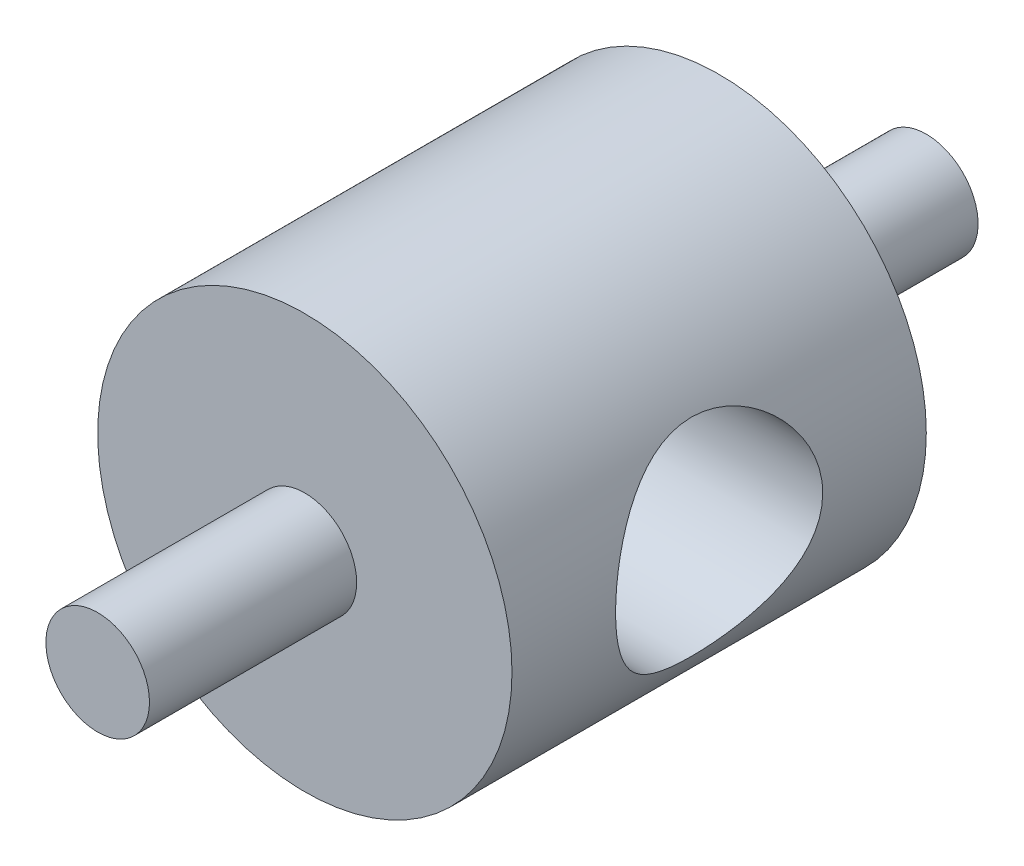
ISO-10303-21;
HEADER;
FILE_DESCRIPTION(('STEP AP214'),'2;1');
FILE_NAME('part.step','',(''),(''),'','','');
FILE_SCHEMA(('AUTOMOTIVE_DESIGN { 1 0 10303 214 1 1 1 1 }'));
ENDSEC;
DATA;
#1=APPLICATION_CONTEXT('core data for automotive mechanical design processes');
#2=APPLICATION_PROTOCOL_DEFINITION('international standard','automotive_design',2000,#1);
#3=PRODUCT_CONTEXT('',#1,'mechanical');
#4=PRODUCT('Part','Part','',(#3));
#5=PRODUCT_RELATED_PRODUCT_CATEGORY('part','',(#4));
#6=PRODUCT_DEFINITION_FORMATION('','',#4);
#7=PRODUCT_DEFINITION_CONTEXT('part definition',#1,'design');
#8=PRODUCT_DEFINITION('design','',#6,#7);
#9=PRODUCT_DEFINITION_SHAPE('','',#8);
#10=(LENGTH_UNIT() NAMED_UNIT(*) SI_UNIT(.MILLI.,.METRE.));
#11=(NAMED_UNIT(*) PLANE_ANGLE_UNIT() SI_UNIT($,.RADIAN.));
#12=(NAMED_UNIT(*) SI_UNIT($,.STERADIAN.) SOLID_ANGLE_UNIT());
#13=UNCERTAINTY_MEASURE_WITH_UNIT(LENGTH_MEASURE(1.E-05),#10,'distance_accuracy_value','');
#14=(GEOMETRIC_REPRESENTATION_CONTEXT(3) GLOBAL_UNCERTAINTY_ASSIGNED_CONTEXT((#13)) GLOBAL_UNIT_ASSIGNED_CONTEXT((#10,
#11,#12)) REPRESENTATION_CONTEXT('',''));
#15=CARTESIAN_POINT('',(0.,0.,0.));
#16=DIRECTION('',(0.,0.,1.));
#17=DIRECTION('',(1.,0.,0.));
#18=AXIS2_PLACEMENT_3D('',#15,#16,#17);
#19=CARTESIAN_POINT('',(0.,0.,-12.7));
#20=DIRECTION('',(0.,0.,1.));
#21=DIRECTION('',(1.,0.,0.));
#22=AXIS2_PLACEMENT_3D('',#19,#20,#21);
#23=CYLINDRICAL_SURFACE('',#22,1.5875);
#24=CARTESIAN_POINT('',(0.,0.,-12.7));
#25=DIRECTION('',(0.,0.,-1.));
#26=DIRECTION('',(-1.,0.,0.));
#27=AXIS2_PLACEMENT_3D('',#24,#25,#26);
#28=CIRCLE('',#27,1.5875);
#29=CARTESIAN_POINT('',(-1.5875,0.,-12.7));
#30=VERTEX_POINT('',#29);
#31=EDGE_CURVE('E11',#30,#30,#28,.T.);
#32=ORIENTED_EDGE('',*,*,#31,.F.);
#33=EDGE_LOOP('',(#32));
#34=FACE_BOUND('',#33,.T.);
#35=CARTESIAN_POINT('',(0.,0.,-3.175));
#36=DIRECTION('',(0.,0.,-1.));
#37=DIRECTION('',(-1.,0.,0.));
#38=AXIS2_PLACEMENT_3D('',#35,#36,#37);
#39=CIRCLE('',#38,1.5875);
#40=CARTESIAN_POINT('',(-1.5875,0.,-3.175));
#41=VERTEX_POINT('',#40);
#42=EDGE_CURVE('E373',#41,#41,#39,.T.);
#43=ORIENTED_EDGE('',*,*,#42,.T.);
#44=EDGE_LOOP('',(#43));
#45=FACE_BOUND('',#44,.T.);
#46=ADVANCED_FACE('F367',(#34,#45),#23,.T.);
#47=CARTESIAN_POINT('',(0.,0.,-12.7));
#48=DIRECTION('',(0.,0.,-1.));
#49=DIRECTION('',(-1.,0.,0.));
#50=AXIS2_PLACEMENT_3D('',#47,#48,#49);
#51=PLANE('',#50);
#52=ORIENTED_EDGE('',*,*,#31,.T.);
#53=EDGE_LOOP('',(#52));
#54=FACE_BOUND('',#53,.T.);
#55=ADVANCED_FACE('F382',(#54),#51,.T.);
#56=CARTESIAN_POINT('',(0.,0.,-3.175));
#57=DIRECTION('',(0.,0.,-1.));
#58=DIRECTION('',(-1.,0.,0.));
#59=AXIS2_PLACEMENT_3D('',#56,#57,#58);
#60=PLANE('',#59);
#61=ORIENTED_EDGE('',*,*,#42,.F.);
#62=EDGE_LOOP('',(#61));
#63=FACE_BOUND('',#62,.T.);
#64=ADVANCED_FACE('F380',(#63),#60,.F.);
#65=CLOSED_SHELL('',(#46,#55,#64));
#66=MANIFOLD_SOLID_BREP('B2',#65);
#67=CARTESIAN_POINT('',(0.,0.,12.7));
#68=DIRECTION('',(0.,0.,-1.));
#69=DIRECTION('',(-1.,0.,0.));
#70=AXIS2_PLACEMENT_3D('',#67,#68,#69);
#71=CYLINDRICAL_SURFACE('',#70,1.5875);
#72=CARTESIAN_POINT('',(0.,0.,12.7));
#73=DIRECTION('',(0.,0.,1.));
#74=DIRECTION('',(1.,0.,0.));
#75=AXIS2_PLACEMENT_3D('',#72,#73,#74);
#76=CIRCLE('',#75,1.5875);
#77=CARTESIAN_POINT('',(1.5875,0.,12.7));
#78=VERTEX_POINT('',#77);
#79=EDGE_CURVE('E366',#78,#78,#76,.T.);
#80=ORIENTED_EDGE('',*,*,#79,.F.);
#81=EDGE_LOOP('',(#80));
#82=FACE_BOUND('',#81,.T.);
#83=CARTESIAN_POINT('',(0.,0.,3.175));
#84=DIRECTION('',(0.,0.,1.));
#85=DIRECTION('',(1.,0.,0.));
#86=AXIS2_PLACEMENT_3D('',#83,#84,#85);
#87=CIRCLE('',#86,1.5875);
#88=CARTESIAN_POINT('',(1.5875,0.,3.175));
#89=VERTEX_POINT('',#88);
#90=EDGE_CURVE('E414',#89,#89,#87,.T.);
#91=ORIENTED_EDGE('',*,*,#90,.T.);
#92=EDGE_LOOP('',(#91));
#93=FACE_BOUND('',#92,.T.);
#94=ADVANCED_FACE('F408',(#82,#93),#71,.T.);
#95=CARTESIAN_POINT('',(0.,0.,12.7));
#96=DIRECTION('',(0.,0.,1.));
#97=DIRECTION('',(1.,0.,0.));
#98=AXIS2_PLACEMENT_3D('',#95,#96,#97);
#99=PLANE('',#98);
#100=ORIENTED_EDGE('',*,*,#79,.T.);
#101=EDGE_LOOP('',(#100));
#102=FACE_BOUND('',#101,.T.);
#103=ADVANCED_FACE('F423',(#102),#99,.T.);
#104=CARTESIAN_POINT('',(0.,0.,3.175));
#105=DIRECTION('',(0.,0.,1.));
#106=DIRECTION('',(1.,0.,0.));
#107=AXIS2_PLACEMENT_3D('',#104,#105,#106);
#108=PLANE('',#107);
#109=ORIENTED_EDGE('',*,*,#90,.F.);
#110=EDGE_LOOP('',(#109));
#111=FACE_BOUND('',#110,.T.);
#112=ADVANCED_FACE('F421',(#111),#108,.F.);
#113=CLOSED_SHELL('',(#94,#103,#112));
#114=MANIFOLD_SOLID_BREP('B6',#113);
#115=CARTESIAN_POINT('',(0.,0.,6.35));
#116=DIRECTION('',(0.,0.,-1.));
#117=DIRECTION('',(-1.,0.,0.));
#118=AXIS2_PLACEMENT_3D('',#115,#116,#117);
#119=CYLINDRICAL_SURFACE('',#118,6.35);
#120=CARTESIAN_POINT('',(6.35,0.,3.175));
#121=CARTESIAN_POINT('',(6.34999931166444,0.0834969220594998,3.17499911228237));
#122=CARTESIAN_POINT('',(6.34834758911701,0.167002655580042,3.17170012555405));
#123=CARTESIAN_POINT('',(6.34179105821714,0.333378330258781,3.15855412545011));
#124=CARTESIAN_POINT('',(6.33688483467113,0.416247978955771,3.14870426347423));
#125=CARTESIAN_POINT('',(6.31742426748325,0.66318203064701,3.10942793495399));
#126=CARTESIAN_POINT('',(6.29812827299425,0.825450146761554,3.0702749225986));
#127=CARTESIAN_POINT('',(6.2489182313574,1.13965128900426,2.96800928870585));
#128=CARTESIAN_POINT('',(6.21904547786825,1.29162180811868,2.90498978075659));
#129=CARTESIAN_POINT('',(6.15142812041637,1.58264035037879,2.7572639263711));
#130=CARTESIAN_POINT('',(6.11368413715877,1.72168939123018,2.67255928984904));
#131=CARTESIAN_POINT('',(6.03111096182982,1.99234108848171,2.47803037026578));
#132=CARTESIAN_POINT('',(5.98599127270818,2.12298433900091,2.36699642220607));
#133=CARTESIAN_POINT('',(5.89470535591056,2.36467069069853,2.12560331642721));
#134=CARTESIAN_POINT('',(5.84853836069043,2.47569885601321,1.99522957023356));
#135=CARTESIAN_POINT('',(5.75623634934464,2.68368848497886,1.70657905224669));
#136=CARTESIAN_POINT('',(5.71038146176788,2.77889135161934,1.54692246869841));
#137=CARTESIAN_POINT('',(5.64919759286363,2.90019349951534,1.29545201282557));
#138=CARTESIAN_POINT('',(5.63006420805933,2.93705266116892,1.20959993817132));
#139=CARTESIAN_POINT('',(5.59504604853267,3.00322508739606,1.03441438629358));
#140=CARTESIAN_POINT('',(5.57915935583429,3.03254280972159,0.945083001819447));
#141=CARTESIAN_POINT('',(5.55212611635049,3.08174263292982,0.768989448035257));
#142=CARTESIAN_POINT('',(5.54075429137746,3.10208128111978,0.682389205971436));
#143=CARTESIAN_POINT('',(5.52193654886444,3.13545600360765,0.507412721005601));
#144=CARTESIAN_POINT('',(5.51448854851135,3.14849595237257,0.419037446228298));
#145=CARTESIAN_POINT('',(5.50383875782918,3.1670771305344,0.241293261151383));
#146=CARTESIAN_POINT('',(5.50063441026522,3.1726228759965,0.151924982012601));
#147=CARTESIAN_POINT('',(5.49859788398609,3.17614778806993,-0.0269807841780854));
#148=CARTESIAN_POINT('',(5.49976528812799,3.17412767659872,-0.116518254271338));
#149=CARTESIAN_POINT('',(5.50899190362733,3.1581193033026,-0.362747875724405));
#150=CARTESIAN_POINT('',(5.52160857357707,3.13621253452965,-0.518841729813365));
#151=CARTESIAN_POINT('',(5.55866493052824,3.07003746372168,-0.82464664130653));
#152=CARTESIAN_POINT('',(5.58310838358077,3.02576203854504,-0.974355649022765));
#153=CARTESIAN_POINT('',(5.64157885407237,2.91531509833647,-1.26754429656414));
#154=CARTESIAN_POINT('',(5.67581583876129,2.84865758129418,-1.41079760993662));
#155=CARTESIAN_POINT('',(5.75003268807633,2.69570761526054,-1.68476608617402));
#156=CARTESIAN_POINT('',(5.79001512927804,2.60940634674629,-1.81547557960851));
#157=CARTESIAN_POINT('',(5.87734289018611,2.40685964249565,-2.07810427425029));
#158=CARTESIAN_POINT('',(5.92497898403936,2.28820488335253,-2.20807538485651));
#159=CARTESIAN_POINT('',(6.01813700574905,2.03058898448427,-2.44708514286384));
#160=CARTESIAN_POINT('',(6.06365791538158,1.89161819563546,-2.5561137863587));
#161=CARTESIAN_POINT('',(6.1500381059768,1.58913989972483,-2.75490191971972));
#162=CARTESIAN_POINT('',(6.19058274974572,1.42479265164789,-2.84353148557994));
#163=CARTESIAN_POINT('',(6.25976272299952,1.08098023585583,-2.99115808163535));
#164=CARTESIAN_POINT('',(6.28840750578946,0.901527205073897,-3.05017864113171));
#165=CARTESIAN_POINT('',(6.32854759690358,0.548533610626835,-3.13205940339905));
#166=CARTESIAN_POINT('',(6.34126679122995,0.375734359385247,-3.15750967258734));
#167=CARTESIAN_POINT('',(6.35231817716325,0.0278752299448336,-3.17965052226026));
#168=CARTESIAN_POINT('',(6.35065718436129,-0.147183538060017,-3.17635472713932));
#169=CARTESIAN_POINT('',(6.33384535408399,-0.480164686080361,-3.14259376405461));
#170=CARTESIAN_POINT('',(6.31975005060431,-0.638363620564188,-3.11425420852516));
#171=CARTESIAN_POINT('',(6.28085393924121,-0.947441883052999,-3.03454412179011));
#172=CARTESIAN_POINT('',(6.25605195113515,-1.09832040207141,-2.98317105152272));
#173=CARTESIAN_POINT('',(6.19709998236334,-1.39347133182512,-2.8575048690622));
#174=CARTESIAN_POINT('',(6.16270299610717,-1.53743151047822,-2.78259841588881));
#175=CARTESIAN_POINT('',(6.08787118465664,-1.8112148234104,-2.61268357431413));
#176=CARTESIAN_POINT('',(6.0474337895468,-1.94103189959927,-2.5176666226146));
#177=CARTESIAN_POINT('',(5.95973602709939,-2.19636241342679,-2.29946064962623));
#178=CARTESIAN_POINT('',(5.91219559251098,-2.3202013468198,-2.17442139288844));
#179=CARTESIAN_POINT('',(5.81858093231368,-2.54589381918874,-1.90523764485025));
#180=CARTESIAN_POINT('',(5.77250773963547,-2.6477321493525,-1.76108004761907));
#181=CARTESIAN_POINT('',(5.68487535288742,-2.83117262876716,-1.44893139804165));
#182=CARTESIAN_POINT('',(5.64364281441821,-2.91155594998014,-1.28012423048962));
#183=CARTESIAN_POINT('',(5.5744767953732,-3.04191297152938,-0.928655535110328));
#184=CARTESIAN_POINT('',(5.54652618900869,-3.0919258549222,-0.746012202152618));
#185=CARTESIAN_POINT('',(5.51057765714603,-3.15551086037918,-0.390810043529835));
#186=CARTESIAN_POINT('',(5.50092192343245,-3.17212027309711,-0.218966249592789));
#187=CARTESIAN_POINT('',(5.49800001145358,-3.17718805563876,0.125244442495203));
#188=CARTESIAN_POINT('',(5.5047267290444,-3.16565862768386,0.297611081542637));
#189=CARTESIAN_POINT('',(5.53205211477784,-3.11761548073658,0.620660103073908));
#190=CARTESIAN_POINT('',(5.55126823076269,-3.08358651207686,0.771843941731147));
#191=CARTESIAN_POINT('',(5.59977978302582,-2.99458164828807,1.06619083016717));
#192=CARTESIAN_POINT('',(5.62907846127335,-2.93959901505999,1.2093512828503));
#193=CARTESIAN_POINT('',(5.69685576337174,-2.8061154442137,1.49423369942854));
#194=CARTESIAN_POINT('',(5.73581889480533,-2.72628260503929,1.63521280936567));
#195=CARTESIAN_POINT('',(5.81772207082382,-2.54682759156583,1.9026974317231));
#196=CARTESIAN_POINT('',(5.8606641782013,-2.44719512169931,2.02919535994271));
#197=CARTESIAN_POINT('',(5.95192753761203,-2.21680287661219,2.28009752417706));
#198=CARTESIAN_POINT('',(6.00026839877346,-2.08373188558712,2.40237975641279));
#199=CARTESIAN_POINT('',(6.0921234557675,-1.79751265125244,2.62339787323312));
#200=CARTESIAN_POINT('',(6.13563504323042,-1.64435365457428,2.72212106598272));
#201=CARTESIAN_POINT('',(6.19391073190243,-1.40178715704487,2.85028026619707));
#202=CARTESIAN_POINT('',(6.21223173271383,-1.31842200030918,2.88980058368139));
#203=CARTESIAN_POINT('',(6.24595363475604,-1.1480770102167,2.9615994748237));
#204=CARTESIAN_POINT('',(6.26135597012704,-1.06109897786306,2.99388160653437));
#205=CARTESIAN_POINT('',(6.28875097111981,-0.884361322813109,3.050759345915));
#206=CARTESIAN_POINT('',(6.30075106809478,-0.794608244970573,3.07537171813811));
#207=CARTESIAN_POINT('',(6.32100983571903,-0.612925661591583,3.11666738952989));
#208=CARTESIAN_POINT('',(6.3292707916836,-0.520997521680291,3.13335553219354));
#209=CARTESIAN_POINT('',(6.34032503263334,-0.357531347524374,3.15561628486239));
#210=CARTESIAN_POINT('',(6.34394670812889,-0.286274046488595,3.16287882124963));
#211=CARTESIAN_POINT('',(6.34878452045567,-0.143346668941345,3.17257112653757));
#212=CARTESIAN_POINT('',(6.35000059089052,-0.0716765810914251,3.17500076204683));
#213=CARTESIAN_POINT('',(6.35,0.,3.175));
#214=B_SPLINE_CURVE_WITH_KNOTS('',3,(#120,#121,#122,#123,#124,#125,#126,#127,#128,#129,#130,
#131,#132,#133,#134,#135,#136,#137,#138,#139,#140,#141,#142,#143,#144,#145,#146,#147,#148,#149,
#150,#151,#152,#153,#154,#155,#156,#157,#158,#159,#160,#161,#162,#163,#164,#165,#166,#167,#168,
#169,#170,#171,#172,#173,#174,#175,#176,#177,#178,#179,#180,#181,#182,#183,#184,#185,#186,#187,
#188,#189,#190,#191,#192,#193,#194,#195,#196,#197,#198,#199,#200,#201,#202,#203,#204,#205,#206,
#207,#208,#209,#210,#211,#212,#213),.UNSPECIFIED.,.T.,.F.,(4,2,2,2,2,2,2,2,2,2,2,2,2,2,2,2,2,2,
2,2,2,2,2,2,2,2,2,2,2,2,2,2,2,2,2,2,2,2,2,2,2,2,2,2,2,2,4),(0.,0.25041561210268,
0.500940186864014,1.00234854488129,1.50182051324263,2.00125310940106,2.53090025348452,
3.06094897410615,3.63210298373098,3.91787290005988,4.20347350732849,4.47213270490102,
4.74064915090148,5.00900371453887,5.27733267302576,5.74927594687738,6.22136960256846,
6.70445970327764,7.18776712794021,7.73235646527881,8.27720530143646,8.84735553323666,
9.41705196489304,9.93956405039339,10.4618285011675,10.9436138594975,11.4254523397102,
11.9210677568139,12.4168946391879,12.9614122158798,13.5063050164601,14.0775857365549,
14.6481278321882,15.1639000911419,15.6794487286237,16.1458838633213,16.6124691169503,
17.1104020806943,17.6085946442304,18.1673210354482,18.7263477502426,19.0082017078365,
19.2899168101042,19.5710117490933,19.8519346536844,20.0668939492148,20.2818591776892),.UNSPECIFIED.);
#215=CARTESIAN_POINT('',(6.35,0.,3.175));
#216=VERTEX_POINT('',#215);
#217=EDGE_CURVE('E452',#216,#216,#214,.T.);
#218=ORIENTED_EDGE('',*,*,#217,.T.);
#219=EDGE_LOOP('',(#218));
#220=FACE_BOUND('',#219,.T.);
#221=CARTESIAN_POINT('',(0.,0.,6.35));
#222=DIRECTION('',(0.,0.,1.));
#223=DIRECTION('',(1.,0.,0.));
#224=AXIS2_PLACEMENT_3D('',#221,#222,#223);
#225=CIRCLE('',#224,6.35);
#226=CARTESIAN_POINT('',(6.35,0.,6.35));
#227=VERTEX_POINT('',#226);
#228=EDGE_CURVE('E407',#227,#227,#225,.T.);
#229=ORIENTED_EDGE('',*,*,#228,.F.);
#230=EDGE_LOOP('',(#229));
#231=FACE_BOUND('',#230,.T.);
#232=CARTESIAN_POINT('',(0.,0.,-6.35));
#233=DIRECTION('',(0.,0.,1.));
#234=DIRECTION('',(1.,0.,0.));
#235=AXIS2_PLACEMENT_3D('',#232,#233,#234);
#236=CIRCLE('',#235,6.35);
#237=CARTESIAN_POINT('',(6.35,0.,-6.35));
#238=VERTEX_POINT('',#237);
#239=EDGE_CURVE('E448',#238,#238,#236,.T.);
#240=ORIENTED_EDGE('',*,*,#239,.T.);
#241=EDGE_LOOP('',(#240));
#242=FACE_BOUND('',#241,.T.);
#243=CARTESIAN_POINT('',(-6.35,0.,-3.175));
#244=CARTESIAN_POINT('',(-6.34999931166444,-0.0834969220594998,-3.17499911228237));
#245=CARTESIAN_POINT('',(-6.34834758911701,-0.167002655580042,-3.17170012555405));
#246=CARTESIAN_POINT('',(-6.34179105821714,-0.333378330258781,-3.15855412545011));
#247=CARTESIAN_POINT('',(-6.33688483467113,-0.416247978955771,-3.14870426347423));
#248=CARTESIAN_POINT('',(-6.31742426748325,-0.66318203064701,-3.10942793495399));
#249=CARTESIAN_POINT('',(-6.29812827299425,-0.825450146761554,-3.0702749225986));
#250=CARTESIAN_POINT('',(-6.2489182313574,-1.13965128900426,-2.96800928870585));
#251=CARTESIAN_POINT('',(-6.21904547786825,-1.29162180811868,-2.90498978075659));
#252=CARTESIAN_POINT('',(-6.15142812041637,-1.58264035037879,-2.7572639263711));
#253=CARTESIAN_POINT('',(-6.11368413715877,-1.72168939123018,-2.67255928984904));
#254=CARTESIAN_POINT('',(-6.03111096182982,-1.99234108848171,-2.47803037026578));
#255=CARTESIAN_POINT('',(-5.98599127270818,-2.12298433900091,-2.36699642220607));
#256=CARTESIAN_POINT('',(-5.89470535591056,-2.36467069069853,-2.12560331642721));
#257=CARTESIAN_POINT('',(-5.84853836069043,-2.47569885601321,-1.99522957023356));
#258=CARTESIAN_POINT('',(-5.75623634934464,-2.68368848497886,-1.70657905224669));
#259=CARTESIAN_POINT('',(-5.71038146176788,-2.77889135161934,-1.54692246869841));
#260=CARTESIAN_POINT('',(-5.64919759286363,-2.90019349951534,-1.29545201282557));
#261=CARTESIAN_POINT('',(-5.63006420805933,-2.93705266116892,-1.20959993817132));
#262=CARTESIAN_POINT('',(-5.59504604853267,-3.00322508739606,-1.03441438629358));
#263=CARTESIAN_POINT('',(-5.57915935583429,-3.03254280972159,-0.945083001819447));
#264=CARTESIAN_POINT('',(-5.55212611635049,-3.08174263292982,-0.768989448035257));
#265=CARTESIAN_POINT('',(-5.54075429137746,-3.10208128111978,-0.682389205971436));
#266=CARTESIAN_POINT('',(-5.52193654886444,-3.13545600360765,-0.507412721005601));
#267=CARTESIAN_POINT('',(-5.51448854851135,-3.14849595237257,-0.419037446228298));
#268=CARTESIAN_POINT('',(-5.50383875782918,-3.1670771305344,-0.241293261151383));
#269=CARTESIAN_POINT('',(-5.50063441026522,-3.1726228759965,-0.151924982012601));
#270=CARTESIAN_POINT('',(-5.49859788398609,-3.17614778806993,0.0269807841780854));
#271=CARTESIAN_POINT('',(-5.49976528812799,-3.17412767659872,0.116518254271338));
#272=CARTESIAN_POINT('',(-5.50899190362733,-3.1581193033026,0.362747875724405));
#273=CARTESIAN_POINT('',(-5.52160857357707,-3.13621253452965,0.518841729813365));
#274=CARTESIAN_POINT('',(-5.55866493052824,-3.07003746372168,0.82464664130653));
#275=CARTESIAN_POINT('',(-5.58310838358077,-3.02576203854504,0.974355649022765));
#276=CARTESIAN_POINT('',(-5.64157885407237,-2.91531509833647,1.26754429656414));
#277=CARTESIAN_POINT('',(-5.67581583876129,-2.84865758129418,1.41079760993662));
#278=CARTESIAN_POINT('',(-5.75003268807633,-2.69570761526054,1.68476608617402));
#279=CARTESIAN_POINT('',(-5.79001512927804,-2.60940634674629,1.81547557960851));
#280=CARTESIAN_POINT('',(-5.87734289018611,-2.40685964249565,2.07810427425029));
#281=CARTESIAN_POINT('',(-5.92497898403936,-2.28820488335253,2.20807538485651));
#282=CARTESIAN_POINT('',(-6.01813700574905,-2.03058898448427,2.44708514286384));
#283=CARTESIAN_POINT('',(-6.06365791538158,-1.89161819563546,2.5561137863587));
#284=CARTESIAN_POINT('',(-6.1500381059768,-1.58913989972483,2.75490191971972));
#285=CARTESIAN_POINT('',(-6.19058274974572,-1.42479265164789,2.84353148557994));
#286=CARTESIAN_POINT('',(-6.25976272299952,-1.08098023585583,2.99115808163535));
#287=CARTESIAN_POINT('',(-6.28840750578946,-0.901527205073897,3.05017864113171));
#288=CARTESIAN_POINT('',(-6.32854759690358,-0.548533610626835,3.13205940339905));
#289=CARTESIAN_POINT('',(-6.34126679122995,-0.375734359385247,3.15750967258734));
#290=CARTESIAN_POINT('',(-6.35231817716325,-0.0278752299448336,3.17965052226026));
#291=CARTESIAN_POINT('',(-6.35065718436129,0.147183538060017,3.17635472713932));
#292=CARTESIAN_POINT('',(-6.33384535408399,0.480164686080361,3.14259376405461));
#293=CARTESIAN_POINT('',(-6.31975005060431,0.638363620564188,3.11425420852516));
#294=CARTESIAN_POINT('',(-6.28085393924121,0.947441883052999,3.03454412179011));
#295=CARTESIAN_POINT('',(-6.25605195113515,1.09832040207141,2.98317105152272));
#296=CARTESIAN_POINT('',(-6.19709998236334,1.39347133182512,2.8575048690622));
#297=CARTESIAN_POINT('',(-6.16270299610717,1.53743151047822,2.78259841588881));
#298=CARTESIAN_POINT('',(-6.08787118465664,1.8112148234104,2.61268357431413));
#299=CARTESIAN_POINT('',(-6.0474337895468,1.94103189959927,2.5176666226146));
#300=CARTESIAN_POINT('',(-5.95973602709939,2.19636241342679,2.29946064962623));
#301=CARTESIAN_POINT('',(-5.91219559251098,2.3202013468198,2.17442139288844));
#302=CARTESIAN_POINT('',(-5.81858093231368,2.54589381918874,1.90523764485025));
#303=CARTESIAN_POINT('',(-5.77250773963547,2.6477321493525,1.76108004761907));
#304=CARTESIAN_POINT('',(-5.68487535288742,2.83117262876716,1.44893139804165));
#305=CARTESIAN_POINT('',(-5.64364281441821,2.91155594998014,1.28012423048962));
#306=CARTESIAN_POINT('',(-5.5744767953732,3.04191297152938,0.928655535110328));
#307=CARTESIAN_POINT('',(-5.54652618900869,3.0919258549222,0.746012202152618));
#308=CARTESIAN_POINT('',(-5.51057765714603,3.15551086037918,0.390810043529835));
#309=CARTESIAN_POINT('',(-5.50092192343245,3.17212027309711,0.218966249592789));
#310=CARTESIAN_POINT('',(-5.49800001145358,3.17718805563876,-0.125244442495203));
#311=CARTESIAN_POINT('',(-5.5047267290444,3.16565862768386,-0.297611081542637));
#312=CARTESIAN_POINT('',(-5.53205211477784,3.11761548073658,-0.620660103073908));
#313=CARTESIAN_POINT('',(-5.55126823076269,3.08358651207686,-0.771843941731147));
#314=CARTESIAN_POINT('',(-5.59977978302582,2.99458164828807,-1.06619083016717));
#315=CARTESIAN_POINT('',(-5.62907846127335,2.93959901505999,-1.2093512828503));
#316=CARTESIAN_POINT('',(-5.69685576337174,2.8061154442137,-1.49423369942854));
#317=CARTESIAN_POINT('',(-5.73581889480533,2.72628260503929,-1.63521280936567));
#318=CARTESIAN_POINT('',(-5.81772207082382,2.54682759156583,-1.9026974317231));
#319=CARTESIAN_POINT('',(-5.8606641782013,2.44719512169931,-2.02919535994271));
#320=CARTESIAN_POINT('',(-5.95192753761203,2.21680287661219,-2.28009752417706));
#321=CARTESIAN_POINT('',(-6.00026839877346,2.08373188558712,-2.40237975641279));
#322=CARTESIAN_POINT('',(-6.0921234557675,1.79751265125244,-2.62339787323312));
#323=CARTESIAN_POINT('',(-6.13563504323042,1.64435365457428,-2.72212106598272));
#324=CARTESIAN_POINT('',(-6.19391073190243,1.40178715704487,-2.85028026619707));
#325=CARTESIAN_POINT('',(-6.21223173271383,1.31842200030918,-2.88980058368139));
#326=CARTESIAN_POINT('',(-6.24595363475604,1.1480770102167,-2.9615994748237));
#327=CARTESIAN_POINT('',(-6.26135597012704,1.06109897786306,-2.99388160653437));
#328=CARTESIAN_POINT('',(-6.28875097111981,0.884361322813109,-3.050759345915));
#329=CARTESIAN_POINT('',(-6.30075106809478,0.794608244970573,-3.07537171813811));
#330=CARTESIAN_POINT('',(-6.32100983571903,0.612925661591583,-3.11666738952989));
#331=CARTESIAN_POINT('',(-6.3292707916836,0.520997521680291,-3.13335553219354));
#332=CARTESIAN_POINT('',(-6.34032503263334,0.357531347524374,-3.15561628486239));
#333=CARTESIAN_POINT('',(-6.34394670812889,0.286274046488595,-3.16287882124963));
#334=CARTESIAN_POINT('',(-6.34878452045567,0.143346668941345,-3.17257112653757));
#335=CARTESIAN_POINT('',(-6.35000059089052,0.0716765810914251,-3.17500076204683));
#336=CARTESIAN_POINT('',(-6.35,0.,-3.175));
#337=B_SPLINE_CURVE_WITH_KNOTS('',3,(#243,#244,#245,#246,#247,#248,#249,#250,#251,#252,#253,
#254,#255,#256,#257,#258,#259,#260,#261,#262,#263,#264,#265,#266,#267,#268,#269,#270,#271,#272,
#273,#274,#275,#276,#277,#278,#279,#280,#281,#282,#283,#284,#285,#286,#287,#288,#289,#290,#291,
#292,#293,#294,#295,#296,#297,#298,#299,#300,#301,#302,#303,#304,#305,#306,#307,#308,#309,#310,
#311,#312,#313,#314,#315,#316,#317,#318,#319,#320,#321,#322,#323,#324,#325,#326,#327,#328,#329,
#330,#331,#332,#333,#334,#335,#336),.UNSPECIFIED.,.T.,.F.,(4,2,2,2,2,2,2,2,2,2,2,2,2,2,2,2,2,2,
2,2,2,2,2,2,2,2,2,2,2,2,2,2,2,2,2,2,2,2,2,2,2,2,2,2,2,2,4),(0.,0.25041561210268,
0.500940186864014,1.00234854488129,1.50182051324263,2.00125310940106,2.53090025348452,
3.06094897410615,3.63210298373098,3.91787290005988,4.20347350732849,4.47213270490102,
4.74064915090148,5.00900371453887,5.27733267302576,5.74927594687738,6.22136960256846,
6.70445970327764,7.18776712794021,7.73235646527881,8.27720530143646,8.84735553323666,
9.41705196489304,9.93956405039339,10.4618285011675,10.9436138594975,11.4254523397102,
11.9210677568139,12.4168946391879,12.9614122158798,13.5063050164601,14.0775857365549,
14.6481278321882,15.1639000911419,15.6794487286237,16.1458838633213,16.6124691169503,
17.1104020806943,17.6085946442304,18.1673210354482,18.7263477502426,19.0082017078365,
19.2899168101042,19.5710117490933,19.8519346536844,20.0668939492148,20.2818591776892),.UNSPECIFIED.);
#338=CARTESIAN_POINT('',(-6.35,0.,-3.175));
#339=VERTEX_POINT('',#338);
#340=EDGE_CURVE('E456',#339,#339,#337,.T.);
#341=ORIENTED_EDGE('',*,*,#340,.F.);
#342=EDGE_LOOP('',(#341));
#343=FACE_BOUND('',#342,.T.);
#344=ADVANCED_FACE('F442',(#220,#231,#242,#343),#119,.T.);
#345=CARTESIAN_POINT('',(0.,0.,6.35));
#346=DIRECTION('',(0.,0.,1.));
#347=DIRECTION('',(1.,0.,0.));
#348=AXIS2_PLACEMENT_3D('',#345,#346,#347);
#349=PLANE('',#348);
#350=ORIENTED_EDGE('',*,*,#228,.T.);
#351=EDGE_LOOP('',(#350));
#352=FACE_BOUND('',#351,.T.);
#353=ADVANCED_FACE('F477',(#352),#349,.T.);
#354=CARTESIAN_POINT('',(0.,0.,-6.35));
#355=DIRECTION('',(0.,0.,1.));
#356=DIRECTION('',(1.,0.,0.));
#357=AXIS2_PLACEMENT_3D('',#354,#355,#356);
#358=PLANE('',#357);
#359=ORIENTED_EDGE('',*,*,#239,.F.);
#360=EDGE_LOOP('',(#359));
#361=FACE_BOUND('',#360,.T.);
#362=ADVANCED_FACE('F474',(#361),#358,.F.);
#363=CARTESIAN_POINT('',(6.351,0.,0.));
#364=DIRECTION('',(-1.,0.,0.));
#365=DIRECTION('',(0.,0.,1.));
#366=AXIS2_PLACEMENT_3D('',#363,#364,#365);
#367=CYLINDRICAL_SURFACE('',#366,3.175);
#368=ORIENTED_EDGE('',*,*,#217,.F.);
#369=EDGE_LOOP('',(#368));
#370=FACE_BOUND('',#369,.T.);
#371=ORIENTED_EDGE('',*,*,#340,.T.);
#372=EDGE_LOOP('',(#371));
#373=FACE_BOUND('',#372,.T.);
#374=ADVANCED_FACE('F467',(#370,#373),#367,.F.);
#375=CLOSED_SHELL('',(#344,#353,#362,#374));
#376=MANIFOLD_SOLID_BREP('B361',#375);
#377=ADVANCED_BREP_SHAPE_REPRESENTATION('',(#18,#66,#114,#376),#14);
#378=SHAPE_DEFINITION_REPRESENTATION(#9,#377);
ENDSEC;
END-ISO-10303-21;
